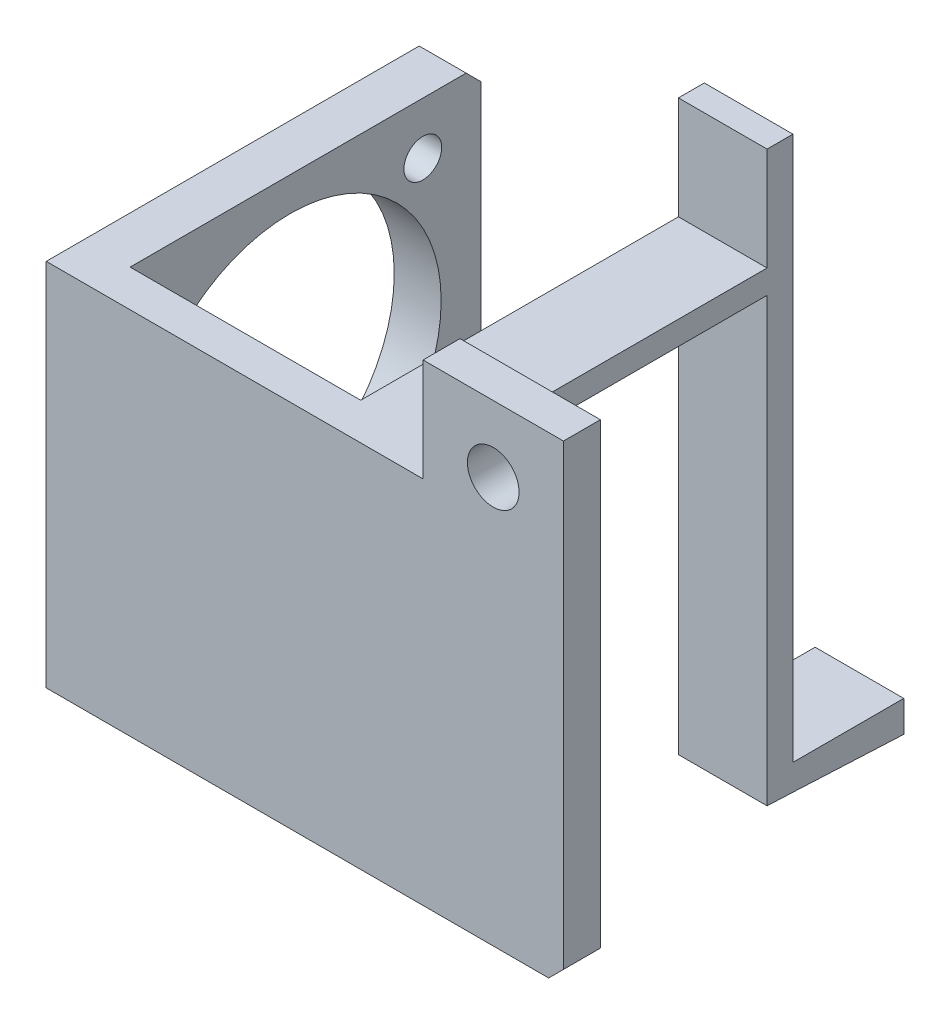
ISO-10303-21;
HEADER;
FILE_DESCRIPTION(('STEP AP214'),'2;1');
FILE_NAME('part.step','',(''),(''),'','','');
FILE_SCHEMA(('AUTOMOTIVE_DESIGN { 1 0 10303 214 1 1 1 1 }'));
ENDSEC;
DATA;
#1=APPLICATION_CONTEXT('core data for automotive mechanical design processes');
#2=APPLICATION_PROTOCOL_DEFINITION('international standard','automotive_design',2000,#1);
#3=PRODUCT_CONTEXT('',#1,'mechanical');
#4=PRODUCT('Part','Part','',(#3));
#5=PRODUCT_RELATED_PRODUCT_CATEGORY('part','',(#4));
#6=PRODUCT_DEFINITION_FORMATION('','',#4);
#7=PRODUCT_DEFINITION_CONTEXT('part definition',#1,'design');
#8=PRODUCT_DEFINITION('design','',#6,#7);
#9=PRODUCT_DEFINITION_SHAPE('','',#8);
#10=(LENGTH_UNIT() NAMED_UNIT(*) SI_UNIT(.MILLI.,.METRE.));
#11=(NAMED_UNIT(*) PLANE_ANGLE_UNIT() SI_UNIT($,.RADIAN.));
#12=(NAMED_UNIT(*) SI_UNIT($,.STERADIAN.) SOLID_ANGLE_UNIT());
#13=UNCERTAINTY_MEASURE_WITH_UNIT(LENGTH_MEASURE(1.E-05),#10,'distance_accuracy_value','');
#14=(GEOMETRIC_REPRESENTATION_CONTEXT(3) GLOBAL_UNCERTAINTY_ASSIGNED_CONTEXT((#13)) GLOBAL_UNIT_ASSIGNED_CONTEXT((#10,
#11,#12)) REPRESENTATION_CONTEXT('',''));
#15=CARTESIAN_POINT('',(0.,0.,0.));
#16=DIRECTION('',(0.,0.,1.));
#17=DIRECTION('',(1.,0.,0.));
#18=AXIS2_PLACEMENT_3D('',#15,#16,#17);
#19=CARTESIAN_POINT('',(51.,-27.8779702218171,5.));
#20=DIRECTION('',(0.,1.,0.));
#21=DIRECTION('',(-1.,0.,0.));
#22=AXIS2_PLACEMENT_3D('',#19,#20,#21);
#23=PLANE('',#22);
#24=DIRECTION('',(0.,0.,1.));
#25=VECTOR('',#24,1.);
#26=CARTESIAN_POINT('',(6.35,-27.8779702218171,-52.48));
#27=LINE('',#26,#25);
#28=CARTESIAN_POINT('',(6.35,-27.8779702218171,-45.48));
#29=VERTEX_POINT('',#28);
#30=CARTESIAN_POINT('',(6.35000000000001,-27.8779702218171,0.));
#31=VERTEX_POINT('',#30);
#32=EDGE_CURVE('E309',#29,#31,#27,.T.);
#33=ORIENTED_EDGE('',*,*,#32,.F.);
#34=DIRECTION('',(-1.,0.,0.));
#35=VECTOR('',#34,1.);
#36=CARTESIAN_POINT('',(51.,-27.8779702218171,-45.48));
#37=LINE('',#36,#35);
#38=CARTESIAN_POINT('',(0.,-27.8779702218171,-45.48));
#39=VERTEX_POINT('',#38);
#40=EDGE_CURVE('E245',#29,#39,#37,.T.);
#41=ORIENTED_EDGE('',*,*,#40,.T.);
#42=DIRECTION('',(0.,0.,-1.));
#43=VECTOR('',#42,1.);
#44=CARTESIAN_POINT('',(0.,-27.8779702218171,5.));
#45=LINE('',#44,#43);
#46=CARTESIAN_POINT('',(0.,-27.8779702218171,5.));
#47=VERTEX_POINT('',#46);
#48=EDGE_CURVE('E332',#47,#39,#45,.T.);
#49=ORIENTED_EDGE('',*,*,#48,.F.);
#50=DIRECTION('',(1.,0.,0.));
#51=VECTOR('',#50,1.);
#52=CARTESIAN_POINT('',(51.,-27.8779702218171,5.));
#53=LINE('',#52,#51);
#54=CARTESIAN_POINT('',(51.,-27.8779702218171,5.));
#55=VERTEX_POINT('',#54);
#56=EDGE_CURVE('E312',#47,#55,#53,.T.);
#57=ORIENTED_EDGE('',*,*,#56,.T.);
#58=DIRECTION('',(0.,0.,-1.));
#59=VECTOR('',#58,1.);
#60=CARTESIAN_POINT('',(51.,-27.8779702218171,5.));
#61=LINE('',#60,#59);
#62=CARTESIAN_POINT('',(51.,-27.8779702218171,0.));
#63=VERTEX_POINT('',#62);
#64=EDGE_CURVE('E321',#55,#63,#61,.T.);
#65=ORIENTED_EDGE('',*,*,#64,.T.);
#66=DIRECTION('',(1.,0.,0.));
#67=VECTOR('',#66,1.);
#68=CARTESIAN_POINT('',(51.,-27.8779702218171,0.));
#69=LINE('',#68,#67);
#70=CARTESIAN_POINT('',(49.56,-27.8779702218171,0.));
#71=VERTEX_POINT('',#70);
#72=EDGE_CURVE('E311',#71,#63,#69,.T.);
#73=ORIENTED_EDGE('',*,*,#72,.F.);
#74=DIRECTION('',(0.,0.,1.));
#75=VECTOR('',#74,1.);
#76=CARTESIAN_POINT('',(49.56,-27.8779702218171,-46.5));
#77=LINE('',#76,#75);
#78=CARTESIAN_POINT('',(49.56,-27.8779702218171,-43.));
#79=VERTEX_POINT('',#78);
#80=EDGE_CURVE('E271',#79,#71,#77,.T.);
#81=ORIENTED_EDGE('',*,*,#80,.F.);
#82=DIRECTION('',(-1.,0.,0.));
#83=VECTOR('',#82,1.);
#84=CARTESIAN_POINT('',(51.,-27.8779702218171,-43.));
#85=LINE('',#84,#83);
#86=CARTESIAN_POINT('',(37.56,-27.8779702218171,-43.));
#87=VERTEX_POINT('',#86);
#88=EDGE_CURVE('E390',#79,#87,#85,.T.);
#89=ORIENTED_EDGE('',*,*,#88,.T.);
#90=DIRECTION('',(0.,0.,1.));
#91=VECTOR('',#90,1.);
#92=CARTESIAN_POINT('',(37.56,-27.8779702218171,-46.5));
#93=LINE('',#92,#91);
#94=CARTESIAN_POINT('',(37.56,-27.8779702218171,0.));
#95=VERTEX_POINT('',#94);
#96=EDGE_CURVE('E267',#87,#95,#93,.T.);
#97=ORIENTED_EDGE('',*,*,#96,.T.);
#98=EDGE_CURVE('E322',#31,#95,#69,.T.);
#99=ORIENTED_EDGE('',*,*,#98,.F.);
#100=EDGE_LOOP('',(#33,#41,#49,#57,#65,#73,#81,#89,#97,#99));
#101=FACE_BOUND('',#100,.T.);
#102=ADVANCED_FACE('F43',(#101),#23,.T.);
#103=CARTESIAN_POINT('',(0.,0.,0.));
#104=DIRECTION('',(0.,0.,-1.));
#105=DIRECTION('',(-1.,0.,0.));
#106=AXIS2_PLACEMENT_3D('',#103,#104,#105);
#107=PLANE('',#106);
#108=DIRECTION('',(-1.,0.,0.));
#109=VECTOR('',#108,1.);
#110=CARTESIAN_POINT('',(0.,-13.9389851109086,0.));
#111=LINE('',#110,#109);
#112=CARTESIAN_POINT('',(70.,-13.9389851109086,0.));
#113=VERTEX_POINT('',#112);
#114=CARTESIAN_POINT('',(51.,-13.9389851109085,0.));
#115=VERTEX_POINT('',#114);
#116=EDGE_CURVE('E59',#113,#115,#111,.T.);
#117=ORIENTED_EDGE('',*,*,#116,.F.);
#118=DIRECTION('',(0.,1.,0.));
#119=VECTOR('',#118,1.);
#120=CARTESIAN_POINT('',(70.,64.0610148890915,0.));
#121=LINE('',#120,#119);
#122=CARTESIAN_POINT('',(70.,-75.8779702218171,0.));
#123=VERTEX_POINT('',#122);
#124=EDGE_CURVE('E207',#123,#113,#121,.T.);
#125=ORIENTED_EDGE('',*,*,#124,.F.);
#126=DIRECTION('',(-0.707106781186548,-0.707106781186548,0.));
#127=VECTOR('',#126,1.);
#128=CARTESIAN_POINT('',(72.9389851109086,-72.9389851109086,0.));
#129=LINE('',#128,#127);
#130=CARTESIAN_POINT('',(68.0000000000001,-77.8779702218171,0.));
#131=VERTEX_POINT('',#130);
#132=EDGE_CURVE('E216',#123,#131,#129,.T.);
#133=ORIENTED_EDGE('',*,*,#132,.T.);
#134=DIRECTION('',(-1.,0.,0.));
#135=VECTOR('',#134,1.);
#136=CARTESIAN_POINT('',(0.,-77.8779702218171,0.));
#137=LINE('',#136,#135);
#138=CARTESIAN_POINT('',(6.35000000000001,-77.8779702218171,0.));
#139=VERTEX_POINT('',#138);
#140=EDGE_CURVE('E316',#131,#139,#137,.T.);
#141=ORIENTED_EDGE('',*,*,#140,.T.);
#142=DIRECTION('',(0.,1.,0.));
#143=VECTOR('',#142,1.);
#144=CARTESIAN_POINT('',(6.35,-27.8779702218171,0.));
#145=LINE('',#144,#143);
#146=EDGE_CURVE('E304',#139,#31,#145,.T.);
#147=ORIENTED_EDGE('',*,*,#146,.T.);
#148=ORIENTED_EDGE('',*,*,#98,.T.);
#149=DIRECTION('',(0.,-1.,0.));
#150=VECTOR('',#149,1.);
#151=CARTESIAN_POINT('',(37.56,-27.8779702218171,0.));
#152=LINE('',#151,#150);
#153=CARTESIAN_POINT('',(37.56,-31.0779702218171,0.));
#154=VERTEX_POINT('',#153);
#155=EDGE_CURVE('E398',#95,#154,#152,.T.);
#156=ORIENTED_EDGE('',*,*,#155,.T.);
#157=DIRECTION('',(1.,0.,0.));
#158=VECTOR('',#157,1.);
#159=CARTESIAN_POINT('',(49.56,-31.0779702218171,0.));
#160=LINE('',#159,#158);
#161=CARTESIAN_POINT('',(49.56,-31.0779702218171,0.));
#162=VERTEX_POINT('',#161);
#163=EDGE_CURVE('E262',#154,#162,#160,.T.);
#164=ORIENTED_EDGE('',*,*,#163,.T.);
#165=DIRECTION('',(0.,1.,0.));
#166=VECTOR('',#165,1.);
#167=CARTESIAN_POINT('',(49.56,-27.8779702218171,0.));
#168=LINE('',#167,#166);
#169=EDGE_CURVE('E394',#162,#71,#168,.T.);
#170=ORIENTED_EDGE('',*,*,#169,.T.);
#171=ORIENTED_EDGE('',*,*,#72,.T.);
#172=DIRECTION('',(0.,-1.,0.));
#173=VECTOR('',#172,1.);
#174=CARTESIAN_POINT('',(51.,-13.9389851109085,0.));
#175=LINE('',#174,#173);
#176=EDGE_CURVE('E221',#115,#63,#175,.T.);
#177=ORIENTED_EDGE('',*,*,#176,.F.);
#178=EDGE_LOOP('',(#117,#125,#133,#141,#147,#148,#156,#164,#170,#171,#177));
#179=FACE_BOUND('',#178,.T.);
#180=CARTESIAN_POINT('',(60.5,-22.9389851109085,0.));
#181=DIRECTION('',(0.,0.,1.));
#182=DIRECTION('',(-1.,0.,0.));
#183=AXIS2_PLACEMENT_3D('',#180,#181,#182);
#184=CIRCLE('',#183,3.5);
#185=CARTESIAN_POINT('',(57.,-22.9389851109085,0.));
#186=VERTEX_POINT('',#185);
#187=EDGE_CURVE('E275',#186,#186,#184,.T.);
#188=ORIENTED_EDGE('',*,*,#187,.T.);
#189=EDGE_LOOP('',(#188));
#190=FACE_BOUND('',#189,.T.);
#191=ADVANCED_FACE('F413',(#179,#190),#107,.T.);
#192=CARTESIAN_POINT('',(70.,64.0610148890915,5.));
#193=DIRECTION('',(-1.,0.,0.));
#194=DIRECTION('',(0.,-1.,0.));
#195=AXIS2_PLACEMENT_3D('',#192,#193,#194);
#196=PLANE('',#195);
#197=ORIENTED_EDGE('',*,*,#124,.T.);
#198=DIRECTION('',(0.,0.,-1.));
#199=VECTOR('',#198,1.);
#200=CARTESIAN_POINT('',(70.,-13.9389851109086,5.));
#201=LINE('',#200,#199);
#202=CARTESIAN_POINT('',(70.,-13.9389851109086,5.));
#203=VERTEX_POINT('',#202);
#204=EDGE_CURVE('E193',#203,#113,#201,.T.);
#205=ORIENTED_EDGE('',*,*,#204,.F.);
#206=DIRECTION('',(0.,1.,0.));
#207=VECTOR('',#206,1.);
#208=CARTESIAN_POINT('',(70.,64.0610148890915,5.));
#209=LINE('',#208,#207);
#210=CARTESIAN_POINT('',(70.,-75.8779702218171,5.));
#211=VERTEX_POINT('',#210);
#212=EDGE_CURVE('E204',#211,#203,#209,.T.);
#213=ORIENTED_EDGE('',*,*,#212,.F.);
#214=DIRECTION('',(0.,0.,-1.));
#215=VECTOR('',#214,1.);
#216=CARTESIAN_POINT('',(70.,-75.8779702218171,0.));
#217=LINE('',#216,#215);
#218=EDGE_CURVE('E213',#211,#123,#217,.T.);
#219=ORIENTED_EDGE('',*,*,#218,.T.);
#220=EDGE_LOOP('',(#197,#205,#213,#219));
#221=FACE_BOUND('',#220,.T.);
#222=ADVANCED_FACE('F202',(#221),#196,.F.);
#223=CARTESIAN_POINT('',(0.,0.,5.));
#224=DIRECTION('',(0.,0.,-1.));
#225=DIRECTION('',(-1.,0.,0.));
#226=AXIS2_PLACEMENT_3D('',#223,#224,#225);
#227=PLANE('',#226);
#228=CARTESIAN_POINT('',(60.5,-22.9389851109085,5.));
#229=DIRECTION('',(0.,0.,-1.));
#230=DIRECTION('',(-1.,0.,0.));
#231=AXIS2_PLACEMENT_3D('',#228,#229,#230);
#232=CIRCLE('',#231,3.5);
#233=CARTESIAN_POINT('',(57.,-22.9389851109085,5.));
#234=VERTEX_POINT('',#233);
#235=EDGE_CURVE('E269',#234,#234,#232,.T.);
#236=ORIENTED_EDGE('',*,*,#235,.T.);
#237=EDGE_LOOP('',(#236));
#238=FACE_BOUND('',#237,.T.);
#239=ORIENTED_EDGE('',*,*,#212,.T.);
#240=DIRECTION('',(1.,0.,0.));
#241=VECTOR('',#240,1.);
#242=CARTESIAN_POINT('',(-159.731110219777,-13.9389851109086,5.));
#243=LINE('',#242,#241);
#244=CARTESIAN_POINT('',(51.,-13.9389851109086,5.));
#245=VERTEX_POINT('',#244);
#246=EDGE_CURVE('E190',#245,#203,#243,.T.);
#247=ORIENTED_EDGE('',*,*,#246,.F.);
#248=DIRECTION('',(0.,-1.,0.));
#249=VECTOR('',#248,1.);
#250=CARTESIAN_POINT('',(51.,-13.9389851109085,5.));
#251=LINE('',#250,#249);
#252=EDGE_CURVE('E214',#245,#55,#251,.T.);
#253=ORIENTED_EDGE('',*,*,#252,.T.);
#254=ORIENTED_EDGE('',*,*,#56,.F.);
#255=DIRECTION('',(0.,1.,0.));
#256=VECTOR('',#255,1.);
#257=CARTESIAN_POINT('',(0.,-27.8779702218171,5.));
#258=LINE('',#257,#256);
#259=CARTESIAN_POINT('',(0.,-77.8779702218171,5.));
#260=VERTEX_POINT('',#259);
#261=EDGE_CURVE('E315',#260,#47,#258,.T.);
#262=ORIENTED_EDGE('',*,*,#261,.F.);
#263=DIRECTION('',(-1.,0.,0.));
#264=VECTOR('',#263,1.);
#265=CARTESIAN_POINT('',(0.,-77.8779702218171,5.));
#266=LINE('',#265,#264);
#267=CARTESIAN_POINT('',(68.0000000000001,-77.8779702218171,5.));
#268=VERTEX_POINT('',#267);
#269=EDGE_CURVE('E319',#268,#260,#266,.T.);
#270=ORIENTED_EDGE('',*,*,#269,.F.);
#271=DIRECTION('',(0.707106781186548,0.707106781186548,0.));
#272=VECTOR('',#271,1.);
#273=CARTESIAN_POINT('',(70.,-75.8779702218171,5.));
#274=LINE('',#273,#272);
#275=EDGE_CURVE('E212',#268,#211,#274,.T.);
#276=ORIENTED_EDGE('',*,*,#275,.T.);
#277=EDGE_LOOP('',(#239,#247,#253,#254,#262,#270,#276));
#278=FACE_BOUND('',#277,.T.);
#279=ADVANCED_FACE('F209',(#238,#278),#227,.F.);
#280=CARTESIAN_POINT('',(0.,-77.8779702218171,5.));
#281=DIRECTION('',(0.,-1.,0.));
#282=DIRECTION('',(1.,0.,0.));
#283=AXIS2_PLACEMENT_3D('',#280,#281,#282);
#284=PLANE('',#283);
#285=ORIENTED_EDGE('',*,*,#140,.F.);
#286=DIRECTION('',(0.,0.,1.));
#287=VECTOR('',#286,1.);
#288=CARTESIAN_POINT('',(68.0000000000001,-77.8779702218171,5.));
#289=LINE('',#288,#287);
#290=EDGE_CURVE('E229',#131,#268,#289,.T.);
#291=ORIENTED_EDGE('',*,*,#290,.T.);
#292=ORIENTED_EDGE('',*,*,#269,.T.);
#293=DIRECTION('',(0.,0.,-1.));
#294=VECTOR('',#293,1.);
#295=CARTESIAN_POINT('',(0.,-77.8779702218171,5.));
#296=LINE('',#295,#294);
#297=CARTESIAN_POINT('',(0.,-77.8779702218171,-45.48));
#298=VERTEX_POINT('',#297);
#299=EDGE_CURVE('E329',#260,#298,#296,.T.);
#300=ORIENTED_EDGE('',*,*,#299,.T.);
#301=DIRECTION('',(1.,0.,0.));
#302=VECTOR('',#301,1.);
#303=CARTESIAN_POINT('',(0.,-77.8779702218171,-45.48));
#304=LINE('',#303,#302);
#305=CARTESIAN_POINT('',(6.35000000000001,-77.8779702218171,-45.48));
#306=VERTEX_POINT('',#305);
#307=EDGE_CURVE('E226',#298,#306,#304,.T.);
#308=ORIENTED_EDGE('',*,*,#307,.T.);
#309=DIRECTION('',(0.,0.,1.));
#310=VECTOR('',#309,1.);
#311=CARTESIAN_POINT('',(6.35000000000001,-77.8779702218171,-52.48));
#312=LINE('',#311,#310);
#313=EDGE_CURVE('E307',#306,#139,#312,.T.);
#314=ORIENTED_EDGE('',*,*,#313,.T.);
#315=EDGE_LOOP('',(#285,#291,#292,#300,#308,#314));
#316=FACE_BOUND('',#315,.T.);
#317=ADVANCED_FACE('F431',(#316),#284,.T.);
#318=CARTESIAN_POINT('',(0.,0.,-46.5));
#319=DIRECTION('',(0.,0.,1.));
#320=DIRECTION('',(1.,0.,0.));
#321=AXIS2_PLACEMENT_3D('',#318,#319,#320);
#322=PLANE('',#321);
#323=DIRECTION('',(0.,1.,0.));
#324=VECTOR('',#323,1.);
#325=CARTESIAN_POINT('',(37.56,0.,-46.5));
#326=LINE('',#325,#324);
#327=CARTESIAN_POINT('',(37.56,-87.5746130747018,-46.5));
#328=VERTEX_POINT('',#327);
#329=CARTESIAN_POINT('',(37.56,-13.9389851109086,-46.5));
#330=VERTEX_POINT('',#329);
#331=EDGE_CURVE('E223',#328,#330,#326,.T.);
#332=ORIENTED_EDGE('',*,*,#331,.T.);
#333=DIRECTION('',(1.,0.,0.));
#334=VECTOR('',#333,1.);
#335=CARTESIAN_POINT('',(0.,-13.9389851109086,-46.5));
#336=LINE('',#335,#334);
#337=CARTESIAN_POINT('',(49.56,-13.9389851109086,-46.5));
#338=VERTEX_POINT('',#337);
#339=EDGE_CURVE('E341',#330,#338,#336,.T.);
#340=ORIENTED_EDGE('',*,*,#339,.T.);
#341=DIRECTION('',(0.,-1.,0.));
#342=VECTOR('',#341,1.);
#343=CARTESIAN_POINT('',(49.56,0.,-46.5));
#344=LINE('',#343,#342);
#345=CARTESIAN_POINT('',(49.5599999999998,-87.5746130747019,-46.5));
#346=VERTEX_POINT('',#345);
#347=EDGE_CURVE('E335',#338,#346,#344,.T.);
#348=ORIENTED_EDGE('',*,*,#347,.T.);
#349=DIRECTION('',(1.,0.,0.));
#350=VECTOR('',#349,1.);
#351=CARTESIAN_POINT('',(-42.4634266051924,-87.5746130747017,-46.5));
#352=LINE('',#351,#350);
#353=EDGE_CURVE('E344',#328,#346,#352,.T.);
#354=ORIENTED_EDGE('',*,*,#353,.F.);
#355=EDGE_LOOP('',(#332,#340,#348,#354));
#356=FACE_BOUND('',#355,.T.);
#357=ADVANCED_FACE('F340',(#356),#322,.F.);
#358=CARTESIAN_POINT('',(51.,-13.9389851109085,5.));
#359=DIRECTION('',(1.,0.,0.));
#360=DIRECTION('',(0.,0.,-1.));
#361=AXIS2_PLACEMENT_3D('',#358,#359,#360);
#362=PLANE('',#361);
#363=ORIENTED_EDGE('',*,*,#252,.F.);
#364=DIRECTION('',(0.,0.,-1.));
#365=VECTOR('',#364,1.);
#366=CARTESIAN_POINT('',(51.,-13.9389851109085,5.));
#367=LINE('',#366,#365);
#368=EDGE_CURVE('E194',#245,#115,#367,.T.);
#369=ORIENTED_EDGE('',*,*,#368,.T.);
#370=ORIENTED_EDGE('',*,*,#176,.T.);
#371=ORIENTED_EDGE('',*,*,#64,.F.);
#372=EDGE_LOOP('',(#363,#369,#370,#371));
#373=FACE_BOUND('',#372,.T.);
#374=ADVANCED_FACE('F425',(#373),#362,.F.);
#375=CARTESIAN_POINT('',(49.56,0.,-46.5));
#376=DIRECTION('',(-1.,0.,0.));
#377=DIRECTION('',(0.,-1.,0.));
#378=AXIS2_PLACEMENT_3D('',#375,#376,#377);
#379=PLANE('',#378);
#380=ORIENTED_EDGE('',*,*,#347,.F.);
#381=DIRECTION('',(0.,0.,1.));
#382=VECTOR('',#381,1.);
#383=CARTESIAN_POINT('',(49.56,-13.9389851109086,-46.5));
#384=LINE('',#383,#382);
#385=CARTESIAN_POINT('',(49.56,-13.9389851109086,-43.));
#386=VERTEX_POINT('',#385);
#387=EDGE_CURVE('E420',#338,#386,#384,.T.);
#388=ORIENTED_EDGE('',*,*,#387,.T.);
#389=DIRECTION('',(0.,-1.,0.));
#390=VECTOR('',#389,1.);
#391=CARTESIAN_POINT('',(49.56,75.6254310840446,-43.));
#392=LINE('',#391,#390);
#393=EDGE_CURVE('E387',#386,#79,#392,.T.);
#394=ORIENTED_EDGE('',*,*,#393,.T.);
#395=ORIENTED_EDGE('',*,*,#80,.T.);
#396=ORIENTED_EDGE('',*,*,#169,.F.);
#397=DIRECTION('',(0.,0.,1.));
#398=VECTOR('',#397,1.);
#399=CARTESIAN_POINT('',(49.56,-31.0779702218171,-46.5));
#400=LINE('',#399,#398);
#401=CARTESIAN_POINT('',(49.5599999999999,-31.0779702218171,-43.));
#402=VERTEX_POINT('',#401);
#403=EDGE_CURVE('E266',#402,#162,#400,.T.);
#404=ORIENTED_EDGE('',*,*,#403,.F.);
#405=DIRECTION('',(0.,-1.,0.));
#406=VECTOR('',#405,1.);
#407=CARTESIAN_POINT('',(49.5599999999998,-90.9199987527818,-43.));
#408=LINE('',#407,#406);
#409=CARTESIAN_POINT('',(49.5599999999998,-90.9199987527818,-43.));
#410=VERTEX_POINT('',#409);
#411=EDGE_CURVE('E255',#402,#410,#408,.T.);
#412=ORIENTED_EDGE('',*,*,#411,.T.);
#413=DIRECTION('',(0.,-0.0441324797854622,-0.999025687471541));
#414=VECTOR('',#413,1.);
#415=CARTESIAN_POINT('',(49.5599999999998,-90.9199987527818,-43.));
#416=LINE('',#415,#414);
#417=CARTESIAN_POINT('',(49.5599999999998,-91.0746130747019,-46.5));
#418=VERTEX_POINT('',#417);
#419=EDGE_CURVE('E378',#410,#418,#416,.T.);
#420=ORIENTED_EDGE('',*,*,#419,.T.);
#421=DIRECTION('',(0.,-0.0479447993683981,-0.99884998684163));
#422=VECTOR('',#421,1.);
#423=CARTESIAN_POINT('',(49.5599999999998,-91.0746130747019,-46.5));
#424=LINE('',#423,#422);
#425=CARTESIAN_POINT('',(49.5599999999998,-91.7946130747019,-61.5));
#426=VERTEX_POINT('',#425);
#427=EDGE_CURVE('E369',#418,#426,#424,.T.);
#428=ORIENTED_EDGE('',*,*,#427,.T.);
#429=DIRECTION('',(0.,1.,0.));
#430=VECTOR('',#429,1.);
#431=CARTESIAN_POINT('',(49.5599999999998,-91.7946130747019,-61.5));
#432=LINE('',#431,#430);
#433=CARTESIAN_POINT('',(49.5599999999998,-87.5746130747019,-61.5));
#434=VERTEX_POINT('',#433);
#435=EDGE_CURVE('E372',#426,#434,#432,.T.);
#436=ORIENTED_EDGE('',*,*,#435,.T.);
#437=DIRECTION('',(0.,0.,1.));
#438=VECTOR('',#437,1.);
#439=CARTESIAN_POINT('',(49.5599999999998,-87.5746130747019,-61.5));
#440=LINE('',#439,#438);
#441=EDGE_CURVE('E375',#434,#346,#440,.T.);
#442=ORIENTED_EDGE('',*,*,#441,.T.);
#443=EDGE_LOOP('',(#380,#388,#394,#395,#396,#404,#412,#420,#428,#436,#442));
#444=FACE_BOUND('',#443,.T.);
#445=ADVANCED_FACE('F403',(#444),#379,.F.);
#446=CARTESIAN_POINT('',(37.56,0.,-46.5));
#447=DIRECTION('',(1.,0.,0.));
#448=DIRECTION('',(0.,0.,-1.));
#449=AXIS2_PLACEMENT_3D('',#446,#447,#448);
#450=PLANE('',#449);
#451=DIRECTION('',(0.,-1.,0.));
#452=VECTOR('',#451,1.);
#453=CARTESIAN_POINT('',(37.56,75.6254310840446,-43.));
#454=LINE('',#453,#452);
#455=CARTESIAN_POINT('',(37.56,-13.9389851109086,-43.));
#456=VERTEX_POINT('',#455);
#457=EDGE_CURVE('E388',#456,#87,#454,.T.);
#458=ORIENTED_EDGE('',*,*,#457,.F.);
#459=DIRECTION('',(0.,0.,-1.));
#460=VECTOR('',#459,1.);
#461=CARTESIAN_POINT('',(37.56,-13.9389851109086,-46.5));
#462=LINE('',#461,#460);
#463=EDGE_CURVE('E67',#456,#330,#462,.T.);
#464=ORIENTED_EDGE('',*,*,#463,.T.);
#465=ORIENTED_EDGE('',*,*,#331,.F.);
#466=DIRECTION('',(0.,0.,-1.));
#467=VECTOR('',#466,1.);
#468=CARTESIAN_POINT('',(37.56,-87.5746130747018,-61.5));
#469=LINE('',#468,#467);
#470=CARTESIAN_POINT('',(37.56,-87.5746130747018,-61.5));
#471=VERTEX_POINT('',#470);
#472=EDGE_CURVE('E348',#328,#471,#469,.T.);
#473=ORIENTED_EDGE('',*,*,#472,.T.);
#474=DIRECTION('',(0.,-1.,0.));
#475=VECTOR('',#474,1.);
#476=CARTESIAN_POINT('',(37.56,-91.7946130747017,-61.5));
#477=LINE('',#476,#475);
#478=CARTESIAN_POINT('',(37.56,-91.7946130747019,-61.5));
#479=VERTEX_POINT('',#478);
#480=EDGE_CURVE('E368',#471,#479,#477,.T.);
#481=ORIENTED_EDGE('',*,*,#480,.T.);
#482=DIRECTION('',(0.,0.0479447993683981,0.99884998684163));
#483=VECTOR('',#482,1.);
#484=CARTESIAN_POINT('',(37.56,-91.0746130747019,-46.5));
#485=LINE('',#484,#483);
#486=CARTESIAN_POINT('',(37.56,-91.0746130747019,-46.5));
#487=VERTEX_POINT('',#486);
#488=EDGE_CURVE('E366',#479,#487,#485,.T.);
#489=ORIENTED_EDGE('',*,*,#488,.T.);
#490=DIRECTION('',(0.,0.0441324797854622,0.999025687471541));
#491=VECTOR('',#490,1.);
#492=CARTESIAN_POINT('',(37.56,-90.9199987527818,-43.));
#493=LINE('',#492,#491);
#494=CARTESIAN_POINT('',(37.56,-90.9199987527818,-43.));
#495=VERTEX_POINT('',#494);
#496=EDGE_CURVE('E358',#487,#495,#493,.T.);
#497=ORIENTED_EDGE('',*,*,#496,.T.);
#498=DIRECTION('',(0.,1.,0.));
#499=VECTOR('',#498,1.);
#500=CARTESIAN_POINT('',(37.56,-90.9199987527816,-43.));
#501=LINE('',#500,#499);
#502=CARTESIAN_POINT('',(37.56,-31.0779702218171,-43.));
#503=VERTEX_POINT('',#502);
#504=EDGE_CURVE('E253',#495,#503,#501,.T.);
#505=ORIENTED_EDGE('',*,*,#504,.T.);
#506=DIRECTION('',(0.,0.,1.));
#507=VECTOR('',#506,1.);
#508=CARTESIAN_POINT('',(37.56,-31.0779702218171,-46.5));
#509=LINE('',#508,#507);
#510=EDGE_CURVE('E259',#503,#154,#509,.T.);
#511=ORIENTED_EDGE('',*,*,#510,.T.);
#512=ORIENTED_EDGE('',*,*,#155,.F.);
#513=ORIENTED_EDGE('',*,*,#96,.F.);
#514=EDGE_LOOP('',(#458,#464,#465,#473,#481,#489,#497,#505,#511,#512,#513));
#515=FACE_BOUND('',#514,.T.);
#516=ADVANCED_FACE('F347',(#515),#450,.F.);
#517=CARTESIAN_POINT('',(0.,-27.8779702218171,5.));
#518=DIRECTION('',(-1.,0.,0.));
#519=DIRECTION('',(0.,-1.,0.));
#520=AXIS2_PLACEMENT_3D('',#517,#518,#519);
#521=PLANE('',#520);
#522=CARTESIAN_POINT('',(0.,-34.9229702218171,-39.615));
#523=DIRECTION('',(-1.,0.,0.));
#524=DIRECTION('',(0.,-1.,0.));
#525=AXIS2_PLACEMENT_3D('',#522,#523,#524);
#526=CIRCLE('',#525,2.555);
#527=CARTESIAN_POINT('',(0.,-37.4779702218171,-39.615));
#528=VERTEX_POINT('',#527);
#529=EDGE_CURVE('E285',#528,#528,#526,.T.);
#530=ORIENTED_EDGE('',*,*,#529,.F.);
#531=EDGE_LOOP('',(#530));
#532=FACE_BOUND('',#531,.T.);
#533=CARTESIAN_POINT('',(0.,-70.8329702218171,-3.695));
#534=DIRECTION('',(-1.,0.,0.));
#535=DIRECTION('',(0.,-1.,0.));
#536=AXIS2_PLACEMENT_3D('',#533,#534,#535);
#537=CIRCLE('',#536,2.555);
#538=CARTESIAN_POINT('',(0.,-73.3879702218171,-3.695));
#539=VERTEX_POINT('',#538);
#540=EDGE_CURVE('E284',#539,#539,#537,.T.);
#541=ORIENTED_EDGE('',*,*,#540,.F.);
#542=EDGE_LOOP('',(#541));
#543=FACE_BOUND('',#542,.T.);
#544=CARTESIAN_POINT('',(0.,-52.8779702218171,-21.66));
#545=DIRECTION('',(-1.,0.,0.));
#546=DIRECTION('',(0.,-1.,0.));
#547=AXIS2_PLACEMENT_3D('',#544,#545,#546);
#548=CIRCLE('',#547,20.44);
#549=CARTESIAN_POINT('',(0.,-73.3179702218171,-21.66));
#550=VERTEX_POINT('',#549);
#551=EDGE_CURVE('E301',#550,#550,#548,.T.);
#552=ORIENTED_EDGE('',*,*,#551,.F.);
#553=EDGE_LOOP('',(#552));
#554=FACE_BOUND('',#553,.T.);
#555=DIRECTION('',(0.,1.,0.));
#556=VECTOR('',#555,1.);
#557=CARTESIAN_POINT('',(0.,-77.8779702218171,-47.48));
#558=LINE('',#557,#556);
#559=CARTESIAN_POINT('',(0.,-75.8779702218171,-47.48));
#560=VERTEX_POINT('',#559);
#561=CARTESIAN_POINT('',(0.,-29.8779702218171,-47.48));
#562=VERTEX_POINT('',#561);
#563=EDGE_CURVE('E278',#560,#562,#558,.T.);
#564=ORIENTED_EDGE('',*,*,#563,.F.);
#565=DIRECTION('',(0.,0.707106781186543,-0.707106781186552));
#566=VECTOR('',#565,1.);
#567=CARTESIAN_POINT('',(0.,-78.1179702218174,-45.2399999999996));
#568=LINE('',#567,#566);
#569=EDGE_CURVE('E243',#560,#298,#568,.F.);
#570=ORIENTED_EDGE('',*,*,#569,.T.);
#571=ORIENTED_EDGE('',*,*,#299,.F.);
#572=ORIENTED_EDGE('',*,*,#261,.T.);
#573=ORIENTED_EDGE('',*,*,#48,.T.);
#574=DIRECTION('',(0.,0.707106781186551,0.707106781186545));
#575=VECTOR('',#574,1.);
#576=CARTESIAN_POINT('',(0.,-2.63797022181707,-20.2400000000002));
#577=LINE('',#576,#575);
#578=EDGE_CURVE('E241',#39,#562,#577,.F.);
#579=ORIENTED_EDGE('',*,*,#578,.T.);
#580=EDGE_LOOP('',(#564,#570,#571,#572,#573,#579));
#581=FACE_BOUND('',#580,.T.);
#582=ADVANCED_FACE('F453',(#532,#543,#554,#581),#521,.T.);
#583=CARTESIAN_POINT('',(6.35,-27.8779702218171,-52.48));
#584=DIRECTION('',(1.,0.,0.));
#585=DIRECTION('',(0.,1.,0.));
#586=AXIS2_PLACEMENT_3D('',#583,#584,#585);
#587=PLANE('',#586);
#588=CARTESIAN_POINT('',(6.35,-34.9229702218171,-39.615));
#589=DIRECTION('',(-1.,0.,0.));
#590=DIRECTION('',(0.,0.,-1.));
#591=AXIS2_PLACEMENT_3D('',#588,#589,#590);
#592=CIRCLE('',#591,2.555);
#593=CARTESIAN_POINT('',(6.35,-34.9229702218171,-42.17));
#594=VERTEX_POINT('',#593);
#595=EDGE_CURVE('E289',#594,#594,#592,.T.);
#596=ORIENTED_EDGE('',*,*,#595,.T.);
#597=EDGE_LOOP('',(#596));
#598=FACE_BOUND('',#597,.T.);
#599=CARTESIAN_POINT('',(6.35000000000001,-70.8329702218171,-3.695));
#600=DIRECTION('',(-1.,0.,0.));
#601=DIRECTION('',(0.,0.,-1.));
#602=AXIS2_PLACEMENT_3D('',#599,#600,#601);
#603=CIRCLE('',#602,2.555);
#604=CARTESIAN_POINT('',(6.35000000000001,-70.8329702218171,-6.24999999999999));
#605=VERTEX_POINT('',#604);
#606=EDGE_CURVE('E281',#605,#605,#603,.T.);
#607=ORIENTED_EDGE('',*,*,#606,.T.);
#608=EDGE_LOOP('',(#607));
#609=FACE_BOUND('',#608,.T.);
#610=CARTESIAN_POINT('',(6.35000000000001,-52.8779702218171,-21.66));
#611=DIRECTION('',(-1.,0.,0.));
#612=DIRECTION('',(0.,0.,-1.));
#613=AXIS2_PLACEMENT_3D('',#610,#611,#612);
#614=CIRCLE('',#613,20.44);
#615=CARTESIAN_POINT('',(6.35000000000001,-52.8779702218171,-42.1));
#616=VERTEX_POINT('',#615);
#617=EDGE_CURVE('E288',#616,#616,#614,.T.);
#618=ORIENTED_EDGE('',*,*,#617,.T.);
#619=EDGE_LOOP('',(#618));
#620=FACE_BOUND('',#619,.T.);
#621=ORIENTED_EDGE('',*,*,#313,.F.);
#622=DIRECTION('',(0.,-0.707106781186543,0.707106781186552));
#623=VECTOR('',#622,1.);
#624=CARTESIAN_POINT('',(6.35000000000001,-49.3779702218174,-73.98));
#625=LINE('',#624,#623);
#626=CARTESIAN_POINT('',(6.35000000000001,-75.8779702218171,-47.48));
#627=VERTEX_POINT('',#626);
#628=EDGE_CURVE('E234',#306,#627,#625,.F.);
#629=ORIENTED_EDGE('',*,*,#628,.T.);
#630=DIRECTION('',(0.,1.,0.));
#631=VECTOR('',#630,1.);
#632=CARTESIAN_POINT('',(6.35000000000001,-77.8779702218171,-47.48));
#633=LINE('',#632,#631);
#634=CARTESIAN_POINT('',(6.35,-29.8779702218171,-47.48));
#635=VERTEX_POINT('',#634);
#636=EDGE_CURVE('E292',#627,#635,#633,.T.);
#637=ORIENTED_EDGE('',*,*,#636,.T.);
#638=DIRECTION('',(0.,-0.707106781186551,-0.707106781186545));
#639=VECTOR('',#638,1.);
#640=CARTESIAN_POINT('',(6.35,-31.3779702218171,-48.98));
#641=LINE('',#640,#639);
#642=EDGE_CURVE('E232',#635,#29,#641,.F.);
#643=ORIENTED_EDGE('',*,*,#642,.T.);
#644=ORIENTED_EDGE('',*,*,#32,.T.);
#645=ORIENTED_EDGE('',*,*,#146,.F.);
#646=EDGE_LOOP('',(#621,#629,#637,#643,#644,#645));
#647=FACE_BOUND('',#646,.T.);
#648=ADVANCED_FACE('F486',(#598,#609,#620,#647),#587,.T.);
#649=CARTESIAN_POINT('',(-0.00100000000000707,-52.8779702218171,-21.66));
#650=DIRECTION('',(1.,0.,0.));
#651=DIRECTION('',(0.,1.,0.));
#652=AXIS2_PLACEMENT_3D('',#649,#650,#651);
#653=CYLINDRICAL_SURFACE('',#652,20.44);
#654=ORIENTED_EDGE('',*,*,#551,.T.);
#655=EDGE_LOOP('',(#654));
#656=FACE_BOUND('',#655,.T.);
#657=ORIENTED_EDGE('',*,*,#617,.F.);
#658=EDGE_LOOP('',(#657));
#659=FACE_BOUND('',#658,.T.);
#660=ADVANCED_FACE('F493',(#656,#659),#653,.F.);
#661=CARTESIAN_POINT('',(-0.0010000000000036,-70.8329702218171,-3.695));
#662=DIRECTION('',(1.,0.,0.));
#663=DIRECTION('',(0.,1.,0.));
#664=AXIS2_PLACEMENT_3D('',#661,#662,#663);
#665=CYLINDRICAL_SURFACE('',#664,2.555);
#666=ORIENTED_EDGE('',*,*,#540,.T.);
#667=EDGE_LOOP('',(#666));
#668=FACE_BOUND('',#667,.T.);
#669=ORIENTED_EDGE('',*,*,#606,.F.);
#670=EDGE_LOOP('',(#669));
#671=FACE_BOUND('',#670,.T.);
#672=ADVANCED_FACE('F502',(#668,#671),#665,.F.);
#673=CARTESIAN_POINT('',(-0.00100000000001054,-34.9229702218171,-39.615));
#674=DIRECTION('',(1.,0.,0.));
#675=DIRECTION('',(0.,1.,0.));
#676=AXIS2_PLACEMENT_3D('',#673,#674,#675);
#677=CYLINDRICAL_SURFACE('',#676,2.555);
#678=ORIENTED_EDGE('',*,*,#529,.T.);
#679=EDGE_LOOP('',(#678));
#680=FACE_BOUND('',#679,.T.);
#681=ORIENTED_EDGE('',*,*,#595,.F.);
#682=EDGE_LOOP('',(#681));
#683=FACE_BOUND('',#682,.T.);
#684=ADVANCED_FACE('F510',(#680,#683),#677,.F.);
#685=CARTESIAN_POINT('',(-0.00100000000000187,-77.8779702218171,-47.48));
#686=DIRECTION('',(0.,0.,-1.));
#687=DIRECTION('',(0.,1.,0.));
#688=AXIS2_PLACEMENT_3D('',#685,#686,#687);
#689=PLANE('',#688);
#690=ORIENTED_EDGE('',*,*,#636,.F.);
#691=DIRECTION('',(-1.,0.,0.));
#692=VECTOR('',#691,1.);
#693=CARTESIAN_POINT('',(-0.00100000000000223,-75.8779702218171,-47.48));
#694=LINE('',#693,#692);
#695=EDGE_CURVE('E239',#627,#560,#694,.T.);
#696=ORIENTED_EDGE('',*,*,#695,.T.);
#697=ORIENTED_EDGE('',*,*,#563,.T.);
#698=DIRECTION('',(1.,0.,0.));
#699=VECTOR('',#698,1.);
#700=CARTESIAN_POINT('',(-0.00100000000001195,-29.8779702218171,-47.48));
#701=LINE('',#700,#699);
#702=EDGE_CURVE('E236',#562,#635,#701,.T.);
#703=ORIENTED_EDGE('',*,*,#702,.T.);
#704=EDGE_LOOP('',(#690,#696,#697,#703));
#705=FACE_BOUND('',#704,.T.);
#706=ADVANCED_FACE('F518',(#705),#689,.T.);
#707=CARTESIAN_POINT('',(60.5,-22.9389851109085,5.001));
#708=DIRECTION('',(0.,0.,-1.));
#709=DIRECTION('',(-1.,0.,0.));
#710=AXIS2_PLACEMENT_3D('',#707,#708,#709);
#711=CYLINDRICAL_SURFACE('',#710,3.5);
#712=ORIENTED_EDGE('',*,*,#187,.F.);
#713=EDGE_LOOP('',(#712));
#714=FACE_BOUND('',#713,.T.);
#715=ORIENTED_EDGE('',*,*,#235,.F.);
#716=EDGE_LOOP('',(#715));
#717=FACE_BOUND('',#716,.T.);
#718=ADVANCED_FACE('F526',(#714,#717),#711,.F.);
#719=CARTESIAN_POINT('',(49.56,-31.0779702218171,-46.5));
#720=DIRECTION('',(0.,-1.,0.));
#721=DIRECTION('',(1.,0.,0.));
#722=AXIS2_PLACEMENT_3D('',#719,#720,#721);
#723=PLANE('',#722);
#724=DIRECTION('',(-1.,0.,0.));
#725=VECTOR('',#724,1.);
#726=CARTESIAN_POINT('',(49.56,-31.0779702218171,-43.));
#727=LINE('',#726,#725);
#728=EDGE_CURVE('E52',#402,#503,#727,.T.);
#729=ORIENTED_EDGE('',*,*,#728,.F.);
#730=ORIENTED_EDGE('',*,*,#403,.T.);
#731=ORIENTED_EDGE('',*,*,#163,.F.);
#732=ORIENTED_EDGE('',*,*,#510,.F.);
#733=EDGE_LOOP('',(#729,#730,#731,#732));
#734=FACE_BOUND('',#733,.T.);
#735=ADVANCED_FACE('F260',(#734),#723,.T.);
#736=CARTESIAN_POINT('',(37.56,75.6254310840446,-43.));
#737=DIRECTION('',(0.,0.,-1.));
#738=DIRECTION('',(-1.,0.,0.));
#739=AXIS2_PLACEMENT_3D('',#736,#737,#738);
#740=PLANE('',#739);
#741=ORIENTED_EDGE('',*,*,#393,.F.);
#742=DIRECTION('',(-1.,0.,0.));
#743=VECTOR('',#742,1.);
#744=CARTESIAN_POINT('',(37.56,-13.9389851109086,-43.));
#745=LINE('',#744,#743);
#746=EDGE_CURVE('E11',#386,#456,#745,.T.);
#747=ORIENTED_EDGE('',*,*,#746,.T.);
#748=ORIENTED_EDGE('',*,*,#457,.T.);
#749=ORIENTED_EDGE('',*,*,#88,.F.);
#750=EDGE_LOOP('',(#741,#747,#748,#749));
#751=FACE_BOUND('',#750,.T.);
#752=ADVANCED_FACE('F418',(#751),#740,.F.);
#753=CARTESIAN_POINT('',(70.,-75.8779702218171,5.));
#754=DIRECTION('',(0.707106781186548,-0.707106781186548,0.));
#755=DIRECTION('',(0.,0.,1.));
#756=AXIS2_PLACEMENT_3D('',#753,#754,#755);
#757=PLANE('',#756);
#758=ORIENTED_EDGE('',*,*,#275,.F.);
#759=ORIENTED_EDGE('',*,*,#290,.F.);
#760=ORIENTED_EDGE('',*,*,#132,.F.);
#761=ORIENTED_EDGE('',*,*,#218,.F.);
#762=EDGE_LOOP('',(#758,#759,#760,#761));
#763=FACE_BOUND('',#762,.T.);
#764=ADVANCED_FACE('F433',(#763),#757,.T.);
#765=CARTESIAN_POINT('',(0.,-77.8779702218171,-45.48));
#766=DIRECTION('',(0.,0.707106781186552,0.707106781186542));
#767=DIRECTION('',(1.,0.,0.));
#768=AXIS2_PLACEMENT_3D('',#765,#766,#767);
#769=PLANE('',#768);
#770=ORIENTED_EDGE('',*,*,#569,.F.);
#771=ORIENTED_EDGE('',*,*,#695,.F.);
#772=ORIENTED_EDGE('',*,*,#628,.F.);
#773=ORIENTED_EDGE('',*,*,#307,.F.);
#774=EDGE_LOOP('',(#770,#771,#772,#773));
#775=FACE_BOUND('',#774,.T.);
#776=ADVANCED_FACE('F435',(#775),#769,.F.);
#777=CARTESIAN_POINT('',(-0.00100000000001195,-29.8779702218171,-47.48));
#778=DIRECTION('',(0.,-0.707106781186544,0.70710678118655));
#779=DIRECTION('',(1.,0.,0.));
#780=AXIS2_PLACEMENT_3D('',#777,#778,#779);
#781=PLANE('',#780);
#782=ORIENTED_EDGE('',*,*,#578,.F.);
#783=ORIENTED_EDGE('',*,*,#40,.F.);
#784=ORIENTED_EDGE('',*,*,#642,.F.);
#785=ORIENTED_EDGE('',*,*,#702,.F.);
#786=EDGE_LOOP('',(#782,#783,#784,#785));
#787=FACE_BOUND('',#786,.T.);
#788=ADVANCED_FACE('F46',(#787),#781,.F.);
#789=CARTESIAN_POINT('',(-42.4634266051924,-91.0746130747017,-46.5));
#790=DIRECTION('',(0.,-0.99884998684163,0.0479447993683981));
#791=DIRECTION('',(0.,-0.0479447993683981,-0.99884998684163));
#792=AXIS2_PLACEMENT_3D('',#789,#790,#791);
#793=PLANE('',#792);
#794=ORIENTED_EDGE('',*,*,#488,.F.);
#795=DIRECTION('',(1.,0.,0.));
#796=VECTOR('',#795,1.);
#797=CARTESIAN_POINT('',(-42.4634266051924,-91.7946130747017,-61.5));
#798=LINE('',#797,#796);
#799=EDGE_CURVE('E380',#479,#426,#798,.T.);
#800=ORIENTED_EDGE('',*,*,#799,.T.);
#801=ORIENTED_EDGE('',*,*,#427,.F.);
#802=DIRECTION('',(1.,0.,0.));
#803=VECTOR('',#802,1.);
#804=CARTESIAN_POINT('',(-42.4634266051924,-91.0746130747017,-46.5));
#805=LINE('',#804,#803);
#806=EDGE_CURVE('E356',#487,#418,#805,.T.);
#807=ORIENTED_EDGE('',*,*,#806,.F.);
#808=EDGE_LOOP('',(#794,#800,#801,#807));
#809=FACE_BOUND('',#808,.T.);
#810=ADVANCED_FACE('F574',(#809),#793,.T.);
#811=CARTESIAN_POINT('',(-42.4634266051924,-90.9199987527816,-43.));
#812=DIRECTION('',(0.,-0.999025687471541,0.0441324797854622));
#813=DIRECTION('',(0.,-0.0441324797854622,-0.999025687471541));
#814=AXIS2_PLACEMENT_3D('',#811,#812,#813);
#815=PLANE('',#814);
#816=ORIENTED_EDGE('',*,*,#496,.F.);
#817=ORIENTED_EDGE('',*,*,#806,.T.);
#818=ORIENTED_EDGE('',*,*,#419,.F.);
#819=DIRECTION('',(1.,0.,0.));
#820=VECTOR('',#819,1.);
#821=CARTESIAN_POINT('',(-42.4634266051924,-90.9199987527816,-43.));
#822=LINE('',#821,#820);
#823=EDGE_CURVE('E360',#495,#410,#822,.T.);
#824=ORIENTED_EDGE('',*,*,#823,.F.);
#825=EDGE_LOOP('',(#816,#817,#818,#824));
#826=FACE_BOUND('',#825,.T.);
#827=ADVANCED_FACE('F571',(#826),#815,.T.);
#828=CARTESIAN_POINT('',(-42.4634266051924,-90.9199987527816,-43.));
#829=DIRECTION('',(0.,0.,1.));
#830=DIRECTION('',(1.,0.,0.));
#831=AXIS2_PLACEMENT_3D('',#828,#829,#830);
#832=PLANE('',#831);
#833=ORIENTED_EDGE('',*,*,#411,.F.);
#834=ORIENTED_EDGE('',*,*,#728,.T.);
#835=ORIENTED_EDGE('',*,*,#504,.F.);
#836=ORIENTED_EDGE('',*,*,#823,.T.);
#837=EDGE_LOOP('',(#833,#834,#835,#836));
#838=FACE_BOUND('',#837,.T.);
#839=ADVANCED_FACE('F251',(#838),#832,.T.);
#840=CARTESIAN_POINT('',(-42.4634266051924,-87.5746130747017,-61.5));
#841=DIRECTION('',(0.,1.,0.));
#842=DIRECTION('',(-1.,0.,0.));
#843=AXIS2_PLACEMENT_3D('',#840,#841,#842);
#844=PLANE('',#843);
#845=ORIENTED_EDGE('',*,*,#472,.F.);
#846=ORIENTED_EDGE('',*,*,#353,.T.);
#847=ORIENTED_EDGE('',*,*,#441,.F.);
#848=DIRECTION('',(1.,0.,0.));
#849=VECTOR('',#848,1.);
#850=CARTESIAN_POINT('',(-42.4634266051924,-87.5746130747017,-61.5));
#851=LINE('',#850,#849);
#852=EDGE_CURVE('E354',#471,#434,#851,.T.);
#853=ORIENTED_EDGE('',*,*,#852,.F.);
#854=EDGE_LOOP('',(#845,#846,#847,#853));
#855=FACE_BOUND('',#854,.T.);
#856=ADVANCED_FACE('F351',(#855),#844,.T.);
#857=CARTESIAN_POINT('',(-42.4634266051924,-91.7946130747017,-61.5));
#858=DIRECTION('',(0.,0.,-1.));
#859=DIRECTION('',(-1.,0.,0.));
#860=AXIS2_PLACEMENT_3D('',#857,#858,#859);
#861=PLANE('',#860);
#862=ORIENTED_EDGE('',*,*,#480,.F.);
#863=ORIENTED_EDGE('',*,*,#852,.T.);
#864=ORIENTED_EDGE('',*,*,#435,.F.);
#865=ORIENTED_EDGE('',*,*,#799,.F.);
#866=EDGE_LOOP('',(#862,#863,#864,#865));
#867=FACE_BOUND('',#866,.T.);
#868=ADVANCED_FACE('F557',(#867),#861,.T.);
#869=CARTESIAN_POINT('',(-159.731110219777,-13.9389851109086,5.));
#870=DIRECTION('',(0.,-1.,0.));
#871=DIRECTION('',(1.,0.,0.));
#872=AXIS2_PLACEMENT_3D('',#869,#870,#871);
#873=PLANE('',#872);
#874=ORIENTED_EDGE('',*,*,#463,.F.);
#875=ORIENTED_EDGE('',*,*,#746,.F.);
#876=ORIENTED_EDGE('',*,*,#387,.F.);
#877=ORIENTED_EDGE('',*,*,#339,.F.);
#878=EDGE_LOOP('',(#874,#875,#876,#877));
#879=FACE_BOUND('',#878,.T.);
#880=ADVANCED_FACE('F419',(#879),#873,.F.);
#881=ORIENTED_EDGE('',*,*,#116,.T.);
#882=ORIENTED_EDGE('',*,*,#368,.F.);
#883=ORIENTED_EDGE('',*,*,#246,.T.);
#884=ORIENTED_EDGE('',*,*,#204,.T.);
#885=EDGE_LOOP('',(#881,#882,#883,#884));
#886=FACE_BOUND('',#885,.T.);
#887=ADVANCED_FACE('F192',(#886),#873,.F.);
#888=CLOSED_SHELL('',(#102,#191,#222,#279,#317,#357,#374,#445,#516,#582,#648,#660,#672,#684,
#706,#718,#735,#752,#764,#776,#788,#810,#827,#839,#856,#868,#880,#887));
#889=MANIFOLD_SOLID_BREP('B2',#888);
#890=ADVANCED_BREP_SHAPE_REPRESENTATION('',(#18,#889),#14);
#891=SHAPE_DEFINITION_REPRESENTATION(#9,#890);
ENDSEC;
END-ISO-10303-21;
